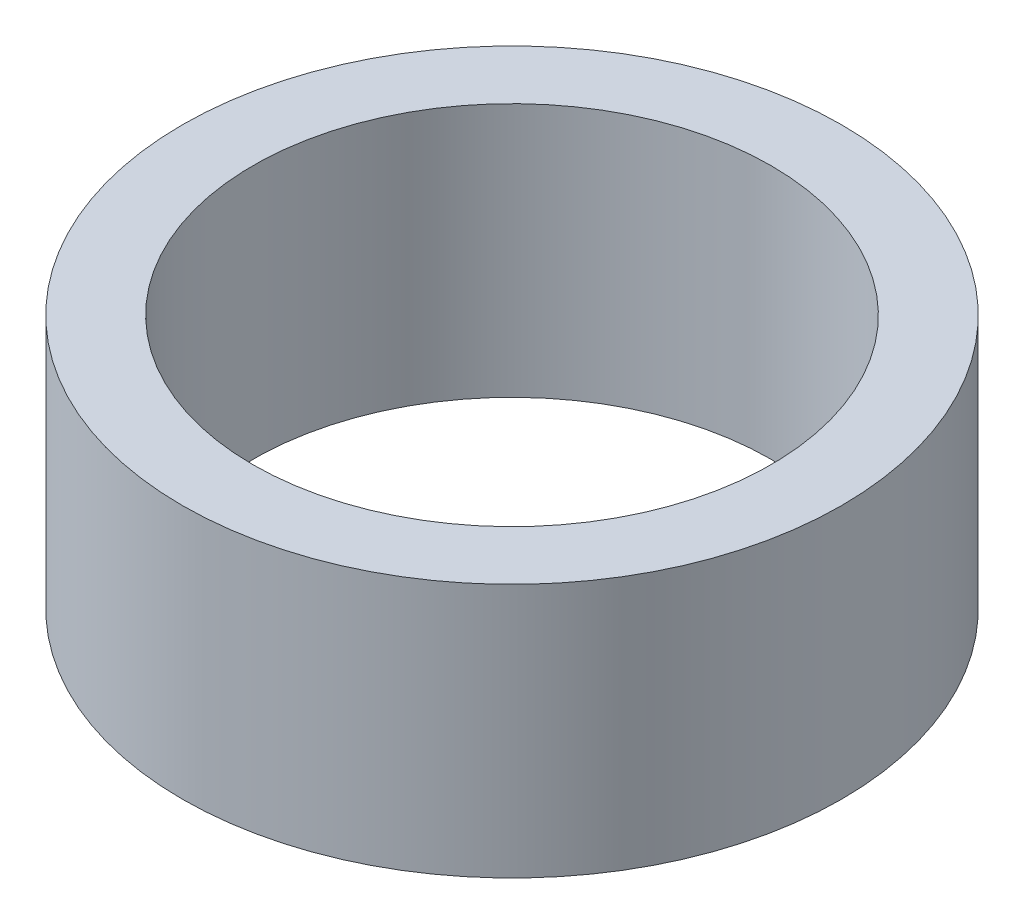
ISO-10303-21;
HEADER;
FILE_DESCRIPTION(('STEP AP214'),'2;1');
FILE_NAME('part.step','',(''),(''),'','','');
FILE_SCHEMA(('AUTOMOTIVE_DESIGN { 1 0 10303 214 1 1 1 1 }'));
ENDSEC;
DATA;
#1=APPLICATION_CONTEXT('core data for automotive mechanical design processes');
#2=APPLICATION_PROTOCOL_DEFINITION('international standard','automotive_design',2000,#1);
#3=PRODUCT_CONTEXT('',#1,'mechanical');
#4=PRODUCT('Part','Part','',(#3));
#5=PRODUCT_RELATED_PRODUCT_CATEGORY('part','',(#4));
#6=PRODUCT_DEFINITION_FORMATION('','',#4);
#7=PRODUCT_DEFINITION_CONTEXT('part definition',#1,'design');
#8=PRODUCT_DEFINITION('design','',#6,#7);
#9=PRODUCT_DEFINITION_SHAPE('','',#8);
#10=(LENGTH_UNIT() NAMED_UNIT(*) SI_UNIT(.MILLI.,.METRE.));
#11=(NAMED_UNIT(*) PLANE_ANGLE_UNIT() SI_UNIT($,.RADIAN.));
#12=(NAMED_UNIT(*) SI_UNIT($,.STERADIAN.) SOLID_ANGLE_UNIT());
#13=UNCERTAINTY_MEASURE_WITH_UNIT(LENGTH_MEASURE(1.E-05),#10,'distance_accuracy_value','');
#14=(GEOMETRIC_REPRESENTATION_CONTEXT(3) GLOBAL_UNCERTAINTY_ASSIGNED_CONTEXT((#13)) GLOBAL_UNIT_ASSIGNED_CONTEXT((#10,
#11,#12)) REPRESENTATION_CONTEXT('',''));
#15=CARTESIAN_POINT('',(0.,0.,0.));
#16=DIRECTION('',(0.,0.,1.));
#17=DIRECTION('',(1.,0.,0.));
#18=AXIS2_PLACEMENT_3D('',#15,#16,#17);
#19=CARTESIAN_POINT('',(0.,27.,0.));
#20=DIRECTION('',(0.,-1.,0.));
#21=DIRECTION('',(0.,0.,-1.));
#22=AXIS2_PLACEMENT_3D('',#19,#20,#21);
#23=CYLINDRICAL_SURFACE('',#22,35.);
#24=CARTESIAN_POINT('',(0.,27.,0.));
#25=DIRECTION('',(0.,1.,0.));
#26=DIRECTION('',(0.,0.,1.));
#27=AXIS2_PLACEMENT_3D('',#24,#25,#26);
#28=CIRCLE('',#27,35.);
#29=CARTESIAN_POINT('',(0.,27.,35.));
#30=VERTEX_POINT('',#29);
#31=EDGE_CURVE('E10',#30,#30,#28,.T.);
#32=ORIENTED_EDGE('',*,*,#31,.F.);
#33=EDGE_LOOP('',(#32));
#34=FACE_BOUND('',#33,.T.);
#35=CARTESIAN_POINT('',(0.,0.,0.));
#36=DIRECTION('',(0.,1.,0.));
#37=DIRECTION('',(0.,0.,1.));
#38=AXIS2_PLACEMENT_3D('',#35,#36,#37);
#39=CIRCLE('',#38,35.);
#40=CARTESIAN_POINT('',(0.,0.,35.));
#41=VERTEX_POINT('',#40);
#42=EDGE_CURVE('E37',#41,#41,#39,.T.);
#43=ORIENTED_EDGE('',*,*,#42,.T.);
#44=EDGE_LOOP('',(#43));
#45=FACE_BOUND('',#44,.T.);
#46=ADVANCED_FACE('F40',(#34,#45),#23,.T.);
#47=CARTESIAN_POINT('',(0.,27.,0.));
#48=DIRECTION('',(0.,1.,0.));
#49=DIRECTION('',(0.,0.,1.));
#50=AXIS2_PLACEMENT_3D('',#47,#48,#49);
#51=PLANE('',#50);
#52=CARTESIAN_POINT('',(0.,27.,0.));
#53=DIRECTION('',(0.,1.,0.));
#54=DIRECTION('',(0.,0.,1.));
#55=AXIS2_PLACEMENT_3D('',#52,#53,#54);
#56=CIRCLE('',#55,27.5);
#57=CARTESIAN_POINT('',(0.,27.,27.5));
#58=VERTEX_POINT('',#57);
#59=EDGE_CURVE('E50',#58,#58,#56,.T.);
#60=ORIENTED_EDGE('',*,*,#59,.F.);
#61=EDGE_LOOP('',(#60));
#62=FACE_BOUND('',#61,.T.);
#63=ORIENTED_EDGE('',*,*,#31,.T.);
#64=EDGE_LOOP('',(#63));
#65=FACE_BOUND('',#64,.T.);
#66=ADVANCED_FACE('F59',(#62,#65),#51,.T.);
#67=CARTESIAN_POINT('',(0.,0.,0.));
#68=DIRECTION('',(0.,1.,0.));
#69=DIRECTION('',(0.,0.,1.));
#70=AXIS2_PLACEMENT_3D('',#67,#68,#69);
#71=PLANE('',#70);
#72=CARTESIAN_POINT('',(0.,0.,0.));
#73=DIRECTION('',(0.,1.,0.));
#74=DIRECTION('',(0.,0.,1.));
#75=AXIS2_PLACEMENT_3D('',#72,#73,#74);
#76=CIRCLE('',#75,27.5);
#77=CARTESIAN_POINT('',(0.,0.,27.5));
#78=VERTEX_POINT('',#77);
#79=EDGE_CURVE('E47',#78,#78,#76,.T.);
#80=ORIENTED_EDGE('',*,*,#79,.T.);
#81=EDGE_LOOP('',(#80));
#82=FACE_BOUND('',#81,.T.);
#83=ORIENTED_EDGE('',*,*,#42,.F.);
#84=EDGE_LOOP('',(#83));
#85=FACE_BOUND('',#84,.T.);
#86=ADVANCED_FACE('F58',(#82,#85),#71,.F.);
#87=CARTESIAN_POINT('',(0.,27.,0.));
#88=DIRECTION('',(0.,-1.,0.));
#89=DIRECTION('',(0.,0.,-1.));
#90=AXIS2_PLACEMENT_3D('',#87,#88,#89);
#91=CYLINDRICAL_SURFACE('',#90,27.5);
#92=ORIENTED_EDGE('',*,*,#59,.T.);
#93=EDGE_LOOP('',(#92));
#94=FACE_BOUND('',#93,.T.);
#95=ORIENTED_EDGE('',*,*,#79,.F.);
#96=EDGE_LOOP('',(#95));
#97=FACE_BOUND('',#96,.T.);
#98=ADVANCED_FACE('F54',(#94,#97),#91,.F.);
#99=CLOSED_SHELL('',(#46,#66,#86,#98));
#100=MANIFOLD_SOLID_BREP('B2',#99);
#101=ADVANCED_BREP_SHAPE_REPRESENTATION('',(#18,#100),#14);
#102=SHAPE_DEFINITION_REPRESENTATION(#9,#101);
ENDSEC;
END-ISO-10303-21;
